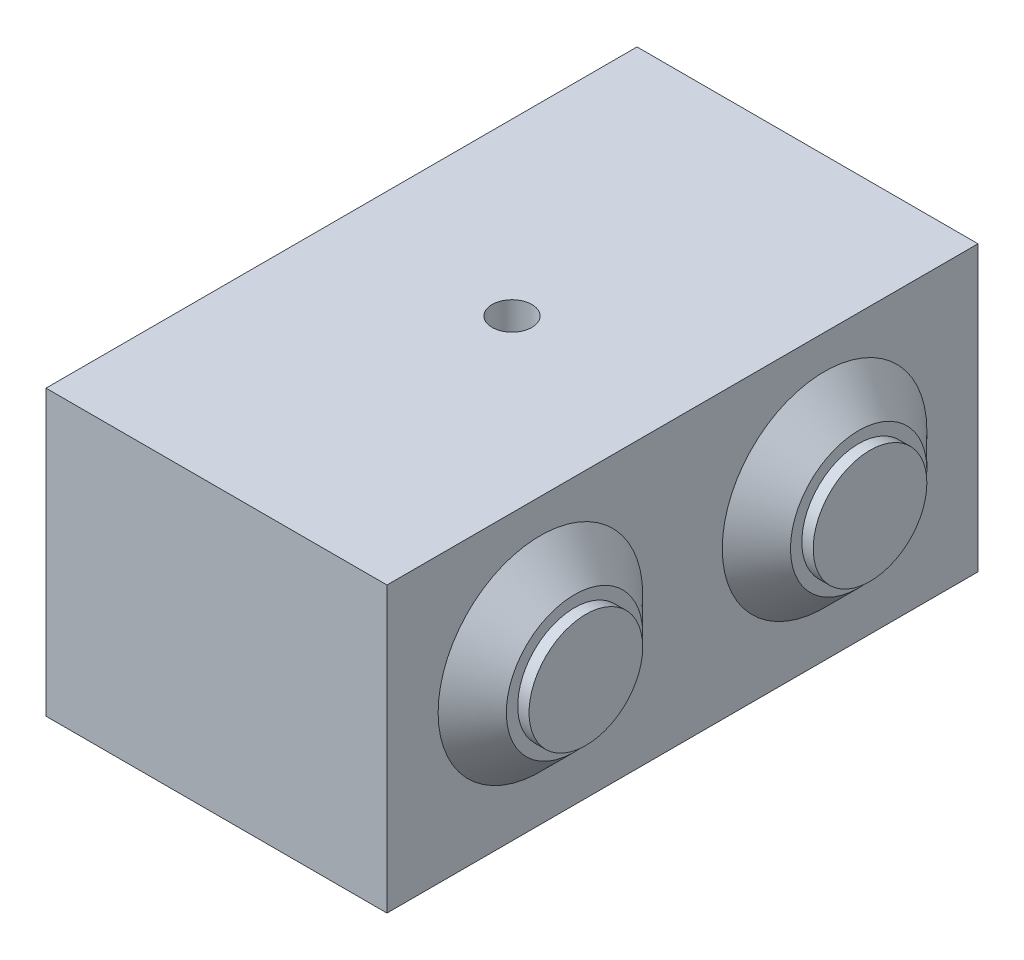
ISO-10303-21;
HEADER;
FILE_DESCRIPTION(('STEP AP214'),'2;1');
FILE_NAME('part.step','',(''),(''),'','','');
FILE_SCHEMA(('AUTOMOTIVE_DESIGN { 1 0 10303 214 1 1 1 1 }'));
ENDSEC;
DATA;
#1=APPLICATION_CONTEXT('core data for automotive mechanical design processes');
#2=APPLICATION_PROTOCOL_DEFINITION('international standard','automotive_design',2000,#1);
#3=PRODUCT_CONTEXT('',#1,'mechanical');
#4=PRODUCT('Part','Part','',(#3));
#5=PRODUCT_RELATED_PRODUCT_CATEGORY('part','',(#4));
#6=PRODUCT_DEFINITION_FORMATION('','',#4);
#7=PRODUCT_DEFINITION_CONTEXT('part definition',#1,'design');
#8=PRODUCT_DEFINITION('design','',#6,#7);
#9=PRODUCT_DEFINITION_SHAPE('','',#8);
#10=(LENGTH_UNIT() NAMED_UNIT(*) SI_UNIT(.MILLI.,.METRE.));
#11=(NAMED_UNIT(*) PLANE_ANGLE_UNIT() SI_UNIT($,.RADIAN.));
#12=(NAMED_UNIT(*) SI_UNIT($,.STERADIAN.) SOLID_ANGLE_UNIT());
#13=UNCERTAINTY_MEASURE_WITH_UNIT(LENGTH_MEASURE(1.E-05),#10,'distance_accuracy_value','');
#14=(GEOMETRIC_REPRESENTATION_CONTEXT(3) GLOBAL_UNCERTAINTY_ASSIGNED_CONTEXT((#13)) GLOBAL_UNIT_ASSIGNED_CONTEXT((#10,
#11,#12)) REPRESENTATION_CONTEXT('',''));
#15=CARTESIAN_POINT('',(0.,0.,0.));
#16=DIRECTION('',(0.,0.,1.));
#17=DIRECTION('',(1.,0.,0.));
#18=AXIS2_PLACEMENT_3D('',#15,#16,#17);
#19=CARTESIAN_POINT('',(0.,25.,0.));
#20=DIRECTION('',(1.,0.,0.));
#21=DIRECTION('',(0.,0.,-1.));
#22=AXIS2_PLACEMENT_3D('',#19,#20,#21);
#23=PLANE('',#22);
#24=DIRECTION('',(0.,0.,1.));
#25=VECTOR('',#24,1.);
#26=CARTESIAN_POINT('',(0.,0.,0.));
#27=LINE('',#26,#25);
#28=CARTESIAN_POINT('',(0.,0.,-52.));
#29=VERTEX_POINT('',#28);
#30=CARTESIAN_POINT('',(0.,0.,0.));
#31=VERTEX_POINT('',#30);
#32=EDGE_CURVE('E110',#29,#31,#27,.T.);
#33=ORIENTED_EDGE('',*,*,#32,.T.);
#34=DIRECTION('',(0.,-1.,0.));
#35=VECTOR('',#34,1.);
#36=CARTESIAN_POINT('',(0.,25.,0.));
#37=LINE('',#36,#35);
#38=CARTESIAN_POINT('',(0.,25.,0.));
#39=VERTEX_POINT('',#38);
#40=EDGE_CURVE('E101',#39,#31,#37,.T.);
#41=ORIENTED_EDGE('',*,*,#40,.F.);
#42=DIRECTION('',(0.,0.,1.));
#43=VECTOR('',#42,1.);
#44=CARTESIAN_POINT('',(0.,25.,0.));
#45=LINE('',#44,#43);
#46=CARTESIAN_POINT('',(0.,25.,-52.));
#47=VERTEX_POINT('',#46);
#48=EDGE_CURVE('E95',#47,#39,#45,.T.);
#49=ORIENTED_EDGE('',*,*,#48,.F.);
#50=DIRECTION('',(0.,-1.,0.));
#51=VECTOR('',#50,1.);
#52=CARTESIAN_POINT('',(0.,25.,-52.));
#53=LINE('',#52,#51);
#54=EDGE_CURVE('E106',#47,#29,#53,.T.);
#55=ORIENTED_EDGE('',*,*,#54,.T.);
#56=EDGE_LOOP('',(#33,#41,#49,#55));
#57=FACE_BOUND('',#56,.T.);
#58=ADVANCED_FACE('F40',(#57),#23,.F.);
#59=CARTESIAN_POINT('',(0.,25.,0.));
#60=DIRECTION('',(0.,0.,-1.));
#61=DIRECTION('',(-1.,0.,0.));
#62=AXIS2_PLACEMENT_3D('',#59,#60,#61);
#63=PLANE('',#62);
#64=DIRECTION('',(1.,0.,0.));
#65=VECTOR('',#64,1.);
#66=CARTESIAN_POINT('',(0.,0.,0.));
#67=LINE('',#66,#65);
#68=CARTESIAN_POINT('',(30.,0.,0.));
#69=VERTEX_POINT('',#68);
#70=EDGE_CURVE('E100',#31,#69,#67,.T.);
#71=ORIENTED_EDGE('',*,*,#70,.T.);
#72=DIRECTION('',(0.,-1.,0.));
#73=VECTOR('',#72,1.);
#74=CARTESIAN_POINT('',(30.,25.,0.));
#75=LINE('',#74,#73);
#76=CARTESIAN_POINT('',(30.,25.,0.));
#77=VERTEX_POINT('',#76);
#78=EDGE_CURVE('E98',#77,#69,#75,.T.);
#79=ORIENTED_EDGE('',*,*,#78,.F.);
#80=DIRECTION('',(1.,0.,0.));
#81=VECTOR('',#80,1.);
#82=CARTESIAN_POINT('',(0.,25.,0.));
#83=LINE('',#82,#81);
#84=EDGE_CURVE('E90',#39,#77,#83,.T.);
#85=ORIENTED_EDGE('',*,*,#84,.F.);
#86=ORIENTED_EDGE('',*,*,#40,.T.);
#87=EDGE_LOOP('',(#71,#79,#85,#86));
#88=FACE_BOUND('',#87,.T.);
#89=ADVANCED_FACE('F99',(#88),#63,.F.);
#90=CARTESIAN_POINT('',(30.,25.,0.));
#91=DIRECTION('',(-1.,0.,0.));
#92=DIRECTION('',(0.,0.,1.));
#93=AXIS2_PLACEMENT_3D('',#90,#91,#92);
#94=PLANE('',#93);
#95=CARTESIAN_POINT('',(30.,13.02188636447,-38.5));
#96=DIRECTION('',(-1.,0.,0.));
#97=DIRECTION('',(0.,0.,1.));
#98=AXIS2_PLACEMENT_3D('',#95,#96,#97);
#99=CIRCLE('',#98,9.);
#100=CARTESIAN_POINT('',(30.,13.02188636447,-29.5));
#101=VERTEX_POINT('',#100);
#102=EDGE_CURVE('E121',#101,#101,#99,.F.);
#103=ORIENTED_EDGE('',*,*,#102,.F.);
#104=EDGE_LOOP('',(#103));
#105=FACE_BOUND('',#104,.T.);
#106=CARTESIAN_POINT('',(30.,13.02188636447,-13.5));
#107=DIRECTION('',(1.,0.,0.));
#108=DIRECTION('',(0.,0.,-1.));
#109=AXIS2_PLACEMENT_3D('',#106,#107,#108);
#110=CIRCLE('',#109,9.);
#111=CARTESIAN_POINT('',(30.,13.02188636447,-22.5));
#112=VERTEX_POINT('',#111);
#113=EDGE_CURVE('E120',#112,#112,#110,.T.);
#114=ORIENTED_EDGE('',*,*,#113,.F.);
#115=EDGE_LOOP('',(#114));
#116=FACE_BOUND('',#115,.T.);
#117=DIRECTION('',(0.,0.,-1.));
#118=VECTOR('',#117,1.);
#119=CARTESIAN_POINT('',(30.,0.,0.));
#120=LINE('',#119,#118);
#121=CARTESIAN_POINT('',(30.,0.,-52.));
#122=VERTEX_POINT('',#121);
#123=EDGE_CURVE('E76',#69,#122,#120,.T.);
#124=ORIENTED_EDGE('',*,*,#123,.T.);
#125=DIRECTION('',(0.,-1.,0.));
#126=VECTOR('',#125,1.);
#127=CARTESIAN_POINT('',(30.,25.,-52.));
#128=LINE('',#127,#126);
#129=CARTESIAN_POINT('',(30.,25.,-52.));
#130=VERTEX_POINT('',#129);
#131=EDGE_CURVE('E102',#130,#122,#128,.T.);
#132=ORIENTED_EDGE('',*,*,#131,.F.);
#133=DIRECTION('',(0.,0.,-1.));
#134=VECTOR('',#133,1.);
#135=CARTESIAN_POINT('',(30.,25.,0.));
#136=LINE('',#135,#134);
#137=EDGE_CURVE('E93',#77,#130,#136,.T.);
#138=ORIENTED_EDGE('',*,*,#137,.F.);
#139=ORIENTED_EDGE('',*,*,#78,.T.);
#140=EDGE_LOOP('',(#124,#132,#138,#139));
#141=FACE_BOUND('',#140,.T.);
#142=ADVANCED_FACE('F104',(#105,#116,#141),#94,.F.);
#143=CARTESIAN_POINT('',(0.,25.,-52.));
#144=DIRECTION('',(0.,0.,1.));
#145=DIRECTION('',(1.,0.,0.));
#146=AXIS2_PLACEMENT_3D('',#143,#144,#145);
#147=PLANE('',#146);
#148=DIRECTION('',(-1.,0.,0.));
#149=VECTOR('',#148,1.);
#150=CARTESIAN_POINT('',(0.,0.,-52.));
#151=LINE('',#150,#149);
#152=EDGE_CURVE('E82',#122,#29,#151,.T.);
#153=ORIENTED_EDGE('',*,*,#152,.T.);
#154=ORIENTED_EDGE('',*,*,#54,.F.);
#155=DIRECTION('',(-1.,0.,0.));
#156=VECTOR('',#155,1.);
#157=CARTESIAN_POINT('',(0.,25.,-52.));
#158=LINE('',#157,#156);
#159=EDGE_CURVE('E59',#130,#47,#158,.T.);
#160=ORIENTED_EDGE('',*,*,#159,.F.);
#161=ORIENTED_EDGE('',*,*,#131,.T.);
#162=EDGE_LOOP('',(#153,#154,#160,#161));
#163=FACE_BOUND('',#162,.T.);
#164=ADVANCED_FACE('F142',(#163),#147,.F.);
#165=CARTESIAN_POINT('',(0.,25.,0.));
#166=DIRECTION('',(0.,-1.,0.));
#167=DIRECTION('',(0.,0.,-1.));
#168=AXIS2_PLACEMENT_3D('',#165,#166,#167);
#169=PLANE('',#168);
#170=CARTESIAN_POINT('',(15.,25.,-26.));
#171=DIRECTION('',(0.,-1.,0.));
#172=DIRECTION('',(0.,0.,-1.));
#173=AXIS2_PLACEMENT_3D('',#170,#171,#172);
#174=CIRCLE('',#173,1.75);
#175=CARTESIAN_POINT('',(15.,25.,-27.75));
#176=VERTEX_POINT('',#175);
#177=EDGE_CURVE('E192',#176,#176,#174,.T.);
#178=ORIENTED_EDGE('',*,*,#177,.T.);
#179=EDGE_LOOP('',(#178));
#180=FACE_BOUND('',#179,.T.);
#181=ORIENTED_EDGE('',*,*,#48,.T.);
#182=ORIENTED_EDGE('',*,*,#84,.T.);
#183=ORIENTED_EDGE('',*,*,#137,.T.);
#184=ORIENTED_EDGE('',*,*,#159,.T.);
#185=EDGE_LOOP('',(#181,#182,#183,#184));
#186=FACE_BOUND('',#185,.T.);
#187=ADVANCED_FACE('F91',(#180,#186),#169,.F.);
#188=CARTESIAN_POINT('',(0.,0.,0.));
#189=DIRECTION('',(0.,-1.,0.));
#190=DIRECTION('',(0.,0.,-1.));
#191=AXIS2_PLACEMENT_3D('',#188,#189,#190);
#192=PLANE('',#191);
#193=CARTESIAN_POINT('',(15.,0.,-26.));
#194=DIRECTION('',(0.,-1.,0.));
#195=DIRECTION('',(0.,0.,-1.));
#196=AXIS2_PLACEMENT_3D('',#193,#194,#195);
#197=CIRCLE('',#196,1.75);
#198=CARTESIAN_POINT('',(15.,0.,-27.75));
#199=VERTEX_POINT('',#198);
#200=EDGE_CURVE('E189',#199,#199,#197,.T.);
#201=ORIENTED_EDGE('',*,*,#200,.F.);
#202=EDGE_LOOP('',(#201));
#203=FACE_BOUND('',#202,.T.);
#204=ORIENTED_EDGE('',*,*,#32,.F.);
#205=ORIENTED_EDGE('',*,*,#152,.F.);
#206=ORIENTED_EDGE('',*,*,#123,.F.);
#207=ORIENTED_EDGE('',*,*,#70,.F.);
#208=EDGE_LOOP('',(#204,#205,#206,#207));
#209=FACE_BOUND('',#208,.T.);
#210=ADVANCED_FACE('F173',(#203,#209),#192,.T.);
#211=CARTESIAN_POINT('',(33.,13.02188636447,-13.5));
#212=DIRECTION('',(1.,0.,0.));
#213=DIRECTION('',(0.,0.,-1.));
#214=AXIS2_PLACEMENT_3D('',#211,#212,#213);
#215=PLANE('',#214);
#216=CARTESIAN_POINT('',(33.,13.02188636447,-13.5));
#217=DIRECTION('',(1.,0.,0.));
#218=DIRECTION('',(0.,0.,-1.));
#219=AXIS2_PLACEMENT_3D('',#216,#217,#218);
#220=CIRCLE('',#219,5.);
#221=CARTESIAN_POINT('',(33.,13.02188636447,-18.5));
#222=VERTEX_POINT('',#221);
#223=EDGE_CURVE('E11',#222,#222,#220,.T.);
#224=ORIENTED_EDGE('',*,*,#223,.F.);
#225=EDGE_LOOP('',(#224));
#226=FACE_BOUND('',#225,.T.);
#227=CARTESIAN_POINT('',(33.,13.02188636447,-13.5));
#228=DIRECTION('',(1.,0.,0.));
#229=DIRECTION('',(0.,0.,-1.));
#230=AXIS2_PLACEMENT_3D('',#227,#228,#229);
#231=CIRCLE('',#230,6.);
#232=CARTESIAN_POINT('',(33.,13.02188636447,-19.5));
#233=VERTEX_POINT('',#232);
#234=EDGE_CURVE('E44',#233,#233,#231,.T.);
#235=ORIENTED_EDGE('',*,*,#234,.T.);
#236=EDGE_LOOP('',(#235));
#237=FACE_BOUND('',#236,.T.);
#238=ADVANCED_FACE('F166',(#226,#237),#215,.T.);
#239=CARTESIAN_POINT('',(33.,13.02188636447,-38.5));
#240=DIRECTION('',(1.,0.,0.));
#241=DIRECTION('',(0.,0.,-1.));
#242=AXIS2_PLACEMENT_3D('',#239,#240,#241);
#243=PLANE('',#242);
#244=CARTESIAN_POINT('',(33.,13.02188636447,-38.5));
#245=DIRECTION('',(1.,0.,0.));
#246=DIRECTION('',(0.,0.,-1.));
#247=AXIS2_PLACEMENT_3D('',#244,#245,#246);
#248=CIRCLE('',#247,5.);
#249=CARTESIAN_POINT('',(33.,13.02188636447,-43.5));
#250=VERTEX_POINT('',#249);
#251=EDGE_CURVE('E50',#250,#250,#248,.T.);
#252=ORIENTED_EDGE('',*,*,#251,.F.);
#253=EDGE_LOOP('',(#252));
#254=FACE_BOUND('',#253,.T.);
#255=CARTESIAN_POINT('',(33.,13.02188636447,-38.5));
#256=DIRECTION('',(1.,0.,0.));
#257=DIRECTION('',(0.,0.,-1.));
#258=AXIS2_PLACEMENT_3D('',#255,#256,#257);
#259=CIRCLE('',#258,6.00000000000001);
#260=CARTESIAN_POINT('',(33.,13.02188636447,-44.5));
#261=VERTEX_POINT('',#260);
#262=EDGE_CURVE('E123',#261,#261,#259,.T.);
#263=ORIENTED_EDGE('',*,*,#262,.T.);
#264=EDGE_LOOP('',(#263));
#265=FACE_BOUND('',#264,.T.);
#266=ADVANCED_FACE('F159',(#254,#265),#243,.T.);
#267=CARTESIAN_POINT('',(33.,13.02188636447,-38.5));
#268=DIRECTION('',(-1.,0.,0.));
#269=DIRECTION('',(0.,0.,1.));
#270=AXIS2_PLACEMENT_3D('',#267,#268,#269);
#271=CONICAL_SURFACE('',#270,6.00000000000001,0.785398163397445);
#272=ORIENTED_EDGE('',*,*,#102,.T.);
#273=EDGE_LOOP('',(#272));
#274=FACE_BOUND('',#273,.T.);
#275=ORIENTED_EDGE('',*,*,#262,.F.);
#276=EDGE_LOOP('',(#275));
#277=FACE_BOUND('',#276,.T.);
#278=ADVANCED_FACE('F157',(#274,#277),#271,.T.);
#279=CARTESIAN_POINT('',(33.,13.02188636447,-13.5));
#280=DIRECTION('',(-1.,0.,0.));
#281=DIRECTION('',(0.,0.,1.));
#282=AXIS2_PLACEMENT_3D('',#279,#280,#281);
#283=CONICAL_SURFACE('',#282,6.,0.785398163397447);
#284=ORIENTED_EDGE('',*,*,#113,.T.);
#285=EDGE_LOOP('',(#284));
#286=FACE_BOUND('',#285,.T.);
#287=ORIENTED_EDGE('',*,*,#234,.F.);
#288=EDGE_LOOP('',(#287));
#289=FACE_BOUND('',#288,.T.);
#290=ADVANCED_FACE('F42',(#286,#289),#283,.T.);
#291=CARTESIAN_POINT('',(34.,13.02188636447,-38.5));
#292=DIRECTION('',(-1.,0.,0.));
#293=DIRECTION('',(0.,0.,1.));
#294=AXIS2_PLACEMENT_3D('',#291,#292,#293);
#295=CYLINDRICAL_SURFACE('',#294,5.);
#296=CARTESIAN_POINT('',(34.,13.02188636447,-38.5));
#297=DIRECTION('',(1.,0.,0.));
#298=DIRECTION('',(0.,0.,-1.));
#299=AXIS2_PLACEMENT_3D('',#296,#297,#298);
#300=CIRCLE('',#299,5.);
#301=CARTESIAN_POINT('',(34.,13.02188636447,-43.5));
#302=VERTEX_POINT('',#301);
#303=EDGE_CURVE('E113',#302,#302,#300,.T.);
#304=ORIENTED_EDGE('',*,*,#303,.F.);
#305=EDGE_LOOP('',(#304));
#306=FACE_BOUND('',#305,.T.);
#307=ORIENTED_EDGE('',*,*,#251,.T.);
#308=EDGE_LOOP('',(#307));
#309=FACE_BOUND('',#308,.T.);
#310=ADVANCED_FACE('F165',(#306,#309),#295,.T.);
#311=CARTESIAN_POINT('',(34.,13.02188636447,-38.5));
#312=DIRECTION('',(1.,0.,0.));
#313=DIRECTION('',(0.,0.,-1.));
#314=AXIS2_PLACEMENT_3D('',#311,#312,#313);
#315=PLANE('',#314);
#316=ORIENTED_EDGE('',*,*,#303,.T.);
#317=EDGE_LOOP('',(#316));
#318=FACE_BOUND('',#317,.T.);
#319=ADVANCED_FACE('F204',(#318),#315,.T.);
#320=CARTESIAN_POINT('',(34.,13.02188636447,-13.5));
#321=DIRECTION('',(-1.,0.,0.));
#322=DIRECTION('',(0.,0.,1.));
#323=AXIS2_PLACEMENT_3D('',#320,#321,#322);
#324=CYLINDRICAL_SURFACE('',#323,5.);
#325=CARTESIAN_POINT('',(34.,13.02188636447,-13.5));
#326=DIRECTION('',(1.,0.,0.));
#327=DIRECTION('',(0.,0.,-1.));
#328=AXIS2_PLACEMENT_3D('',#325,#326,#327);
#329=CIRCLE('',#328,5.);
#330=CARTESIAN_POINT('',(34.,13.02188636447,-18.5));
#331=VERTEX_POINT('',#330);
#332=EDGE_CURVE('E195',#331,#331,#329,.T.);
#333=ORIENTED_EDGE('',*,*,#332,.F.);
#334=EDGE_LOOP('',(#333));
#335=FACE_BOUND('',#334,.T.);
#336=ORIENTED_EDGE('',*,*,#223,.T.);
#337=EDGE_LOOP('',(#336));
#338=FACE_BOUND('',#337,.T.);
#339=ADVANCED_FACE('F210',(#335,#338),#324,.T.);
#340=CARTESIAN_POINT('',(34.,13.02188636447,-13.5));
#341=DIRECTION('',(1.,0.,0.));
#342=DIRECTION('',(0.,0.,-1.));
#343=AXIS2_PLACEMENT_3D('',#340,#341,#342);
#344=PLANE('',#343);
#345=ORIENTED_EDGE('',*,*,#332,.T.);
#346=EDGE_LOOP('',(#345));
#347=FACE_BOUND('',#346,.T.);
#348=ADVANCED_FACE('F214',(#347),#344,.T.);
#349=CARTESIAN_POINT('',(15.,25.,-26.));
#350=DIRECTION('',(0.,-1.,0.));
#351=DIRECTION('',(0.,0.,-1.));
#352=AXIS2_PLACEMENT_3D('',#349,#350,#351);
#353=CYLINDRICAL_SURFACE('',#352,1.75);
#354=ORIENTED_EDGE('',*,*,#177,.F.);
#355=EDGE_LOOP('',(#354));
#356=FACE_BOUND('',#355,.T.);
#357=ORIENTED_EDGE('',*,*,#200,.T.);
#358=EDGE_LOOP('',(#357));
#359=FACE_BOUND('',#358,.T.);
#360=ADVANCED_FACE('F220',(#356,#359),#353,.F.);
#361=CLOSED_SHELL('',(#58,#89,#142,#164,#187,#210,#238,#266,#278,#290,#310,#319,#339,#348,#360));
#362=MANIFOLD_SOLID_BREP('B2',#361);
#363=ADVANCED_BREP_SHAPE_REPRESENTATION('',(#18,#362),#14);
#364=SHAPE_DEFINITION_REPRESENTATION(#9,#363);
ENDSEC;
END-ISO-10303-21;
